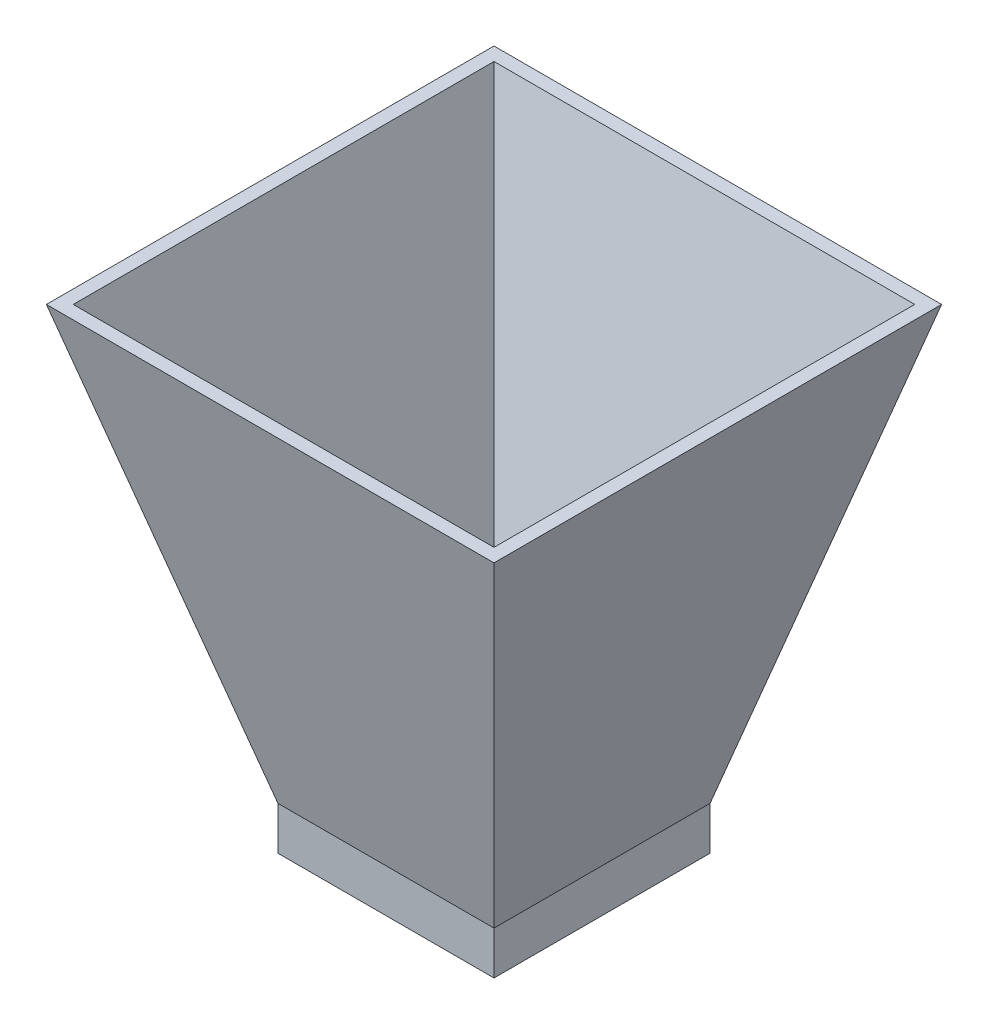
ISO-10303-21;
HEADER;
FILE_DESCRIPTION(('STEP AP214'),'2;1');
FILE_NAME('part.step','',(''),(''),'','','');
FILE_SCHEMA(('AUTOMOTIVE_DESIGN { 1 0 10303 214 1 1 1 1 }'));
ENDSEC;
DATA;
#1=APPLICATION_CONTEXT('core data for automotive mechanical design processes');
#2=APPLICATION_PROTOCOL_DEFINITION('international standard','automotive_design',2000,#1);
#3=PRODUCT_CONTEXT('',#1,'mechanical');
#4=PRODUCT('Part','Part','',(#3));
#5=PRODUCT_RELATED_PRODUCT_CATEGORY('part','',(#4));
#6=PRODUCT_DEFINITION_FORMATION('','',#4);
#7=PRODUCT_DEFINITION_CONTEXT('part definition',#1,'design');
#8=PRODUCT_DEFINITION('design','',#6,#7);
#9=PRODUCT_DEFINITION_SHAPE('','',#8);
#10=(LENGTH_UNIT() NAMED_UNIT(*) SI_UNIT(.MILLI.,.METRE.));
#11=(NAMED_UNIT(*) PLANE_ANGLE_UNIT() SI_UNIT($,.RADIAN.));
#12=(NAMED_UNIT(*) SI_UNIT($,.STERADIAN.) SOLID_ANGLE_UNIT());
#13=UNCERTAINTY_MEASURE_WITH_UNIT(LENGTH_MEASURE(1.E-05),#10,'distance_accuracy_value','');
#14=(GEOMETRIC_REPRESENTATION_CONTEXT(3) GLOBAL_UNCERTAINTY_ASSIGNED_CONTEXT((#13)) GLOBAL_UNIT_ASSIGNED_CONTEXT((#10,
#11,#12)) REPRESENTATION_CONTEXT('',''));
#15=CARTESIAN_POINT('',(0.,0.,0.));
#16=DIRECTION('',(0.,0.,1.));
#17=DIRECTION('',(1.,0.,0.));
#18=AXIS2_PLACEMENT_3D('',#15,#16,#17);
#19=CARTESIAN_POINT('',(0.,0.,0.));
#20=DIRECTION('',(-0.965925826289068,-0.258819045102521,0.));
#21=DIRECTION('',(0.258819045102521,-0.965925826289068,0.));
#22=AXIS2_PLACEMENT_3D('',#19,#20,#21);
#23=PLANE('',#22);
#24=DIRECTION('',(0.,0.,1.));
#25=VECTOR('',#24,1.);
#26=CARTESIAN_POINT('',(0.,0.,0.));
#27=LINE('',#26,#25);
#28=CARTESIAN_POINT('',(0.,0.,0.));
#29=VERTEX_POINT('',#28);
#30=CARTESIAN_POINT('',(0.,0.,50.));
#31=VERTEX_POINT('',#30);
#32=EDGE_CURVE('E190',#29,#31,#27,.T.);
#33=ORIENTED_EDGE('',*,*,#32,.T.);
#34=DIRECTION('',(0.250562807085732,-0.935113126531029,-0.250562807085732));
#35=VECTOR('',#34,1.);
#36=CARTESIAN_POINT('',(0.,0.,50.));
#37=LINE('',#36,#35);
#38=CARTESIAN_POINT('',(-26.7949192431123,100.,76.7949192431123));
#39=VERTEX_POINT('',#38);
#40=EDGE_CURVE('E223',#39,#31,#37,.T.);
#41=ORIENTED_EDGE('',*,*,#40,.F.);
#42=DIRECTION('',(0.,0.,-1.));
#43=VECTOR('',#42,1.);
#44=CARTESIAN_POINT('',(-26.7949192431123,100.,0.));
#45=LINE('',#44,#43);
#46=CARTESIAN_POINT('',(-26.7949192431123,100.,-26.7949192431123));
#47=VERTEX_POINT('',#46);
#48=EDGE_CURVE('E222',#47,#39,#45,.F.);
#49=ORIENTED_EDGE('',*,*,#48,.F.);
#50=DIRECTION('',(0.250562807085732,-0.935113126531029,0.250562807085732));
#51=VECTOR('',#50,1.);
#52=CARTESIAN_POINT('',(0.,0.,0.));
#53=LINE('',#52,#51);
#54=EDGE_CURVE('E228',#47,#29,#53,.T.);
#55=ORIENTED_EDGE('',*,*,#54,.T.);
#56=EDGE_LOOP('',(#33,#41,#49,#55));
#57=FACE_BOUND('',#56,.T.);
#58=ADVANCED_FACE('F32',(#57),#23,.T.);
#59=CARTESIAN_POINT('',(0.,0.,50.));
#60=DIRECTION('',(0.,-0.258819045102521,0.965925826289068));
#61=DIRECTION('',(0.,-0.965925826289068,-0.258819045102521));
#62=AXIS2_PLACEMENT_3D('',#59,#60,#61);
#63=PLANE('',#62);
#64=DIRECTION('',(1.,0.,0.));
#65=VECTOR('',#64,1.);
#66=CARTESIAN_POINT('',(0.,0.,50.));
#67=LINE('',#66,#65);
#68=CARTESIAN_POINT('',(50.,0.,50.));
#69=VERTEX_POINT('',#68);
#70=EDGE_CURVE('E213',#31,#69,#67,.T.);
#71=ORIENTED_EDGE('',*,*,#70,.T.);
#72=DIRECTION('',(-0.250562807085732,-0.935113126531029,-0.250562807085732));
#73=VECTOR('',#72,1.);
#74=CARTESIAN_POINT('',(46.8609139852659,-11.7152284963165,46.8609139852659));
#75=LINE('',#74,#73);
#76=CARTESIAN_POINT('',(76.7949192431123,100.,76.7949192431123));
#77=VERTEX_POINT('',#76);
#78=EDGE_CURVE('E227',#77,#69,#75,.T.);
#79=ORIENTED_EDGE('',*,*,#78,.F.);
#80=DIRECTION('',(-1.,0.,0.));
#81=VECTOR('',#80,1.);
#82=CARTESIAN_POINT('',(0.,100.,76.7949192431123));
#83=LINE('',#82,#81);
#84=EDGE_CURVE('E239',#39,#77,#83,.F.);
#85=ORIENTED_EDGE('',*,*,#84,.F.);
#86=ORIENTED_EDGE('',*,*,#40,.T.);
#87=EDGE_LOOP('',(#71,#79,#85,#86));
#88=FACE_BOUND('',#87,.T.);
#89=ADVANCED_FACE('F34',(#88),#63,.T.);
#90=CARTESIAN_POINT('',(50.,0.,0.));
#91=DIRECTION('',(0.965925826289068,-0.258819045102521,0.));
#92=DIRECTION('',(0.258819045102521,0.965925826289068,0.));
#93=AXIS2_PLACEMENT_3D('',#90,#91,#92);
#94=PLANE('',#93);
#95=DIRECTION('',(0.,0.,-1.));
#96=VECTOR('',#95,1.);
#97=CARTESIAN_POINT('',(50.,0.,0.));
#98=LINE('',#97,#96);
#99=CARTESIAN_POINT('',(50.,0.,0.));
#100=VERTEX_POINT('',#99);
#101=EDGE_CURVE('E216',#69,#100,#98,.T.);
#102=ORIENTED_EDGE('',*,*,#101,.T.);
#103=DIRECTION('',(-0.250562807085732,-0.935113126531029,0.250562807085732));
#104=VECTOR('',#103,1.);
#105=CARTESIAN_POINT('',(46.8609139852659,-11.7152284963165,3.13908601473409));
#106=LINE('',#105,#104);
#107=CARTESIAN_POINT('',(76.7949192431123,100.,-26.7949192431123));
#108=VERTEX_POINT('',#107);
#109=EDGE_CURVE('E231',#108,#100,#106,.T.);
#110=ORIENTED_EDGE('',*,*,#109,.F.);
#111=DIRECTION('',(0.,0.,1.));
#112=VECTOR('',#111,1.);
#113=CARTESIAN_POINT('',(76.7949192431123,100.,0.));
#114=LINE('',#113,#112);
#115=EDGE_CURVE('E241',#77,#108,#114,.F.);
#116=ORIENTED_EDGE('',*,*,#115,.F.);
#117=ORIENTED_EDGE('',*,*,#78,.T.);
#118=EDGE_LOOP('',(#102,#110,#116,#117));
#119=FACE_BOUND('',#118,.T.);
#120=ADVANCED_FACE('F271',(#119),#94,.T.);
#121=CARTESIAN_POINT('',(0.,0.,0.));
#122=DIRECTION('',(0.,-0.258819045102521,-0.965925826289068));
#123=DIRECTION('',(0.,0.965925826289068,-0.258819045102521));
#124=AXIS2_PLACEMENT_3D('',#121,#122,#123);
#125=PLANE('',#124);
#126=DIRECTION('',(-1.,0.,0.));
#127=VECTOR('',#126,1.);
#128=CARTESIAN_POINT('',(0.,0.,0.));
#129=LINE('',#128,#127);
#130=EDGE_CURVE('E219',#100,#29,#129,.T.);
#131=ORIENTED_EDGE('',*,*,#130,.T.);
#132=ORIENTED_EDGE('',*,*,#54,.F.);
#133=DIRECTION('',(1.,0.,0.));
#134=VECTOR('',#133,1.);
#135=CARTESIAN_POINT('',(0.,100.,-26.7949192431123));
#136=LINE('',#135,#134);
#137=EDGE_CURVE('E232',#108,#47,#136,.F.);
#138=ORIENTED_EDGE('',*,*,#137,.F.);
#139=ORIENTED_EDGE('',*,*,#109,.T.);
#140=EDGE_LOOP('',(#131,#132,#138,#139));
#141=FACE_BOUND('',#140,.T.);
#142=ADVANCED_FACE('F277',(#141),#125,.T.);
#143=CARTESIAN_POINT('',(0.,100.,0.));
#144=DIRECTION('',(0.,1.,0.));
#145=DIRECTION('',(0.,0.,1.));
#146=AXIS2_PLACEMENT_3D('',#143,#144,#145);
#147=PLANE('',#146);
#148=DIRECTION('',(0.,0.,-1.));
#149=VECTOR('',#148,1.);
#150=CARTESIAN_POINT('',(-23.6890907018821,100.,0.));
#151=LINE('',#150,#149);
#152=CARTESIAN_POINT('',(-23.6890907018821,100.,-23.6890907018821));
#153=VERTEX_POINT('',#152);
#154=CARTESIAN_POINT('',(-23.6890907018821,100.,73.6890907018821));
#155=VERTEX_POINT('',#154);
#156=EDGE_CURVE('E204',#153,#155,#151,.F.);
#157=ORIENTED_EDGE('',*,*,#156,.F.);
#158=DIRECTION('',(1.,0.,0.));
#159=VECTOR('',#158,1.);
#160=CARTESIAN_POINT('',(0.,100.,-23.6890907018821));
#161=LINE('',#160,#159);
#162=CARTESIAN_POINT('',(73.6890907018821,100.,-23.6890907018821));
#163=VERTEX_POINT('',#162);
#164=EDGE_CURVE('E195',#163,#153,#161,.F.);
#165=ORIENTED_EDGE('',*,*,#164,.F.);
#166=DIRECTION('',(0.,0.,1.));
#167=VECTOR('',#166,1.);
#168=CARTESIAN_POINT('',(73.6890907018821,100.,0.));
#169=LINE('',#168,#167);
#170=CARTESIAN_POINT('',(73.6890907018821,100.,73.6890907018821));
#171=VERTEX_POINT('',#170);
#172=EDGE_CURVE('E208',#171,#163,#169,.F.);
#173=ORIENTED_EDGE('',*,*,#172,.F.);
#174=DIRECTION('',(-1.,0.,0.));
#175=VECTOR('',#174,1.);
#176=CARTESIAN_POINT('',(0.,100.,73.6890907018821));
#177=LINE('',#176,#175);
#178=EDGE_CURVE('E206',#155,#171,#177,.F.);
#179=ORIENTED_EDGE('',*,*,#178,.F.);
#180=EDGE_LOOP('',(#157,#165,#173,#179));
#181=FACE_BOUND('',#180,.T.);
#182=ORIENTED_EDGE('',*,*,#48,.T.);
#183=ORIENTED_EDGE('',*,*,#84,.T.);
#184=ORIENTED_EDGE('',*,*,#115,.T.);
#185=ORIENTED_EDGE('',*,*,#137,.T.);
#186=EDGE_LOOP('',(#182,#183,#184,#185));
#187=FACE_BOUND('',#186,.T.);
#188=ADVANCED_FACE('F275',(#181,#187),#147,.T.);
#189=CARTESIAN_POINT('',(2.8977774788672,0.776457135307564,0.));
#190=DIRECTION('',(-0.965925826289068,-0.258819045102521,0.));
#191=DIRECTION('',(0.258819045102521,-0.965925826289068,0.));
#192=AXIS2_PLACEMENT_3D('',#189,#190,#191);
#193=PLANE('',#192);
#194=DIRECTION('',(0.,0.,-1.));
#195=VECTOR('',#194,1.);
#196=CARTESIAN_POINT('',(2.30198096393688,3.,0.));
#197=LINE('',#196,#195);
#198=CARTESIAN_POINT('',(2.30198096393688,3.,2.30198096393688));
#199=VERTEX_POINT('',#198);
#200=CARTESIAN_POINT('',(2.30198096393688,3.,47.6980190360631));
#201=VERTEX_POINT('',#200);
#202=EDGE_CURVE('E143',#199,#201,#197,.F.);
#203=ORIENTED_EDGE('',*,*,#202,.F.);
#204=DIRECTION('',(0.250562807085732,-0.935113126531029,0.250562807085732));
#205=VECTOR('',#204,1.);
#206=CARTESIAN_POINT('',(2.71585002371274,1.45541964123575,2.71585002371273));
#207=LINE('',#206,#205);
#208=EDGE_CURVE('E192',#153,#199,#207,.T.);
#209=ORIENTED_EDGE('',*,*,#208,.F.);
#210=ORIENTED_EDGE('',*,*,#156,.T.);
#211=DIRECTION('',(0.250562807085732,-0.935113126531029,-0.250562807085732));
#212=VECTOR('',#211,1.);
#213=CARTESIAN_POINT('',(2.71585002371273,1.45541964123575,47.2841499762873));
#214=LINE('',#213,#212);
#215=EDGE_CURVE('E187',#155,#201,#214,.T.);
#216=ORIENTED_EDGE('',*,*,#215,.T.);
#217=EDGE_LOOP('',(#203,#209,#210,#216));
#218=FACE_BOUND('',#217,.T.);
#219=ADVANCED_FACE('F327',(#218),#193,.F.);
#220=CARTESIAN_POINT('',(0.,0.776457135307564,47.1022225211328));
#221=DIRECTION('',(0.,-0.258819045102521,0.965925826289068));
#222=DIRECTION('',(0.,-0.965925826289068,-0.258819045102521));
#223=AXIS2_PLACEMENT_3D('',#220,#221,#222);
#224=PLANE('',#223);
#225=DIRECTION('',(-1.,0.,0.));
#226=VECTOR('',#225,1.);
#227=CARTESIAN_POINT('',(0.,3.,47.6980190360631));
#228=LINE('',#227,#226);
#229=CARTESIAN_POINT('',(47.6980190360631,3.,47.6980190360631));
#230=VERTEX_POINT('',#229);
#231=EDGE_CURVE('E186',#201,#230,#228,.F.);
#232=ORIENTED_EDGE('',*,*,#231,.F.);
#233=ORIENTED_EDGE('',*,*,#215,.F.);
#234=ORIENTED_EDGE('',*,*,#178,.T.);
#235=DIRECTION('',(-0.250562807085732,-0.935113126531029,-0.250562807085732));
#236=VECTOR('',#235,1.);
#237=CARTESIAN_POINT('',(44.1450639615532,-10.2598088550808,44.1450639615532));
#238=LINE('',#237,#236);
#239=EDGE_CURVE('E191',#171,#230,#238,.T.);
#240=ORIENTED_EDGE('',*,*,#239,.T.);
#241=EDGE_LOOP('',(#232,#233,#234,#240));
#242=FACE_BOUND('',#241,.T.);
#243=ADVANCED_FACE('F330',(#242),#224,.F.);
#244=CARTESIAN_POINT('',(47.1022225211328,0.776457135307564,0.));
#245=DIRECTION('',(0.965925826289068,-0.258819045102521,0.));
#246=DIRECTION('',(0.258819045102521,0.965925826289068,0.));
#247=AXIS2_PLACEMENT_3D('',#244,#245,#246);
#248=PLANE('',#247);
#249=DIRECTION('',(0.,0.,1.));
#250=VECTOR('',#249,1.);
#251=CARTESIAN_POINT('',(47.6980190360631,3.,0.));
#252=LINE('',#251,#250);
#253=CARTESIAN_POINT('',(47.6980190360631,3.,2.30198096393688));
#254=VERTEX_POINT('',#253);
#255=EDGE_CURVE('E197',#230,#254,#252,.F.);
#256=ORIENTED_EDGE('',*,*,#255,.F.);
#257=ORIENTED_EDGE('',*,*,#239,.F.);
#258=ORIENTED_EDGE('',*,*,#172,.T.);
#259=DIRECTION('',(-0.250562807085732,-0.935113126531029,0.250562807085732));
#260=VECTOR('',#259,1.);
#261=CARTESIAN_POINT('',(44.1450639615532,-10.2598088550808,5.85493603844683));
#262=LINE('',#261,#260);
#263=EDGE_CURVE('E55',#163,#254,#262,.T.);
#264=ORIENTED_EDGE('',*,*,#263,.T.);
#265=EDGE_LOOP('',(#256,#257,#258,#264));
#266=FACE_BOUND('',#265,.T.);
#267=ADVANCED_FACE('F334',(#266),#248,.F.);
#268=CARTESIAN_POINT('',(0.,0.776457135307564,2.8977774788672));
#269=DIRECTION('',(0.,-0.258819045102521,-0.965925826289068));
#270=DIRECTION('',(0.,0.965925826289068,-0.258819045102521));
#271=AXIS2_PLACEMENT_3D('',#268,#269,#270);
#272=PLANE('',#271);
#273=DIRECTION('',(1.,0.,0.));
#274=VECTOR('',#273,1.);
#275=CARTESIAN_POINT('',(0.,3.,2.30198096393688));
#276=LINE('',#275,#274);
#277=EDGE_CURVE('E201',#254,#199,#276,.F.);
#278=ORIENTED_EDGE('',*,*,#277,.F.);
#279=ORIENTED_EDGE('',*,*,#263,.F.);
#280=ORIENTED_EDGE('',*,*,#164,.T.);
#281=ORIENTED_EDGE('',*,*,#208,.T.);
#282=EDGE_LOOP('',(#278,#279,#280,#281));
#283=FACE_BOUND('',#282,.T.);
#284=ADVANCED_FACE('F325',(#283),#272,.F.);
#285=CARTESIAN_POINT('',(0.,3.,0.));
#286=DIRECTION('',(0.,1.,0.));
#287=DIRECTION('',(0.,0.,1.));
#288=AXIS2_PLACEMENT_3D('',#285,#286,#287);
#289=PLANE('',#288);
#290=DIRECTION('',(0.,0.,-1.));
#291=VECTOR('',#290,1.);
#292=CARTESIAN_POINT('',(47.,3.,0.));
#293=LINE('',#292,#291);
#294=CARTESIAN_POINT('',(47.,3.,47.));
#295=VERTEX_POINT('',#294);
#296=CARTESIAN_POINT('',(47.,3.,3.));
#297=VERTEX_POINT('',#296);
#298=EDGE_CURVE('E11',#295,#297,#293,.T.);
#299=ORIENTED_EDGE('',*,*,#298,.F.);
#300=DIRECTION('',(1.,0.,0.));
#301=VECTOR('',#300,1.);
#302=CARTESIAN_POINT('',(0.,3.,47.));
#303=LINE('',#302,#301);
#304=CARTESIAN_POINT('',(3.,3.,47.));
#305=VERTEX_POINT('',#304);
#306=EDGE_CURVE('E226',#305,#295,#303,.T.);
#307=ORIENTED_EDGE('',*,*,#306,.F.);
#308=DIRECTION('',(0.,0.,1.));
#309=VECTOR('',#308,1.);
#310=CARTESIAN_POINT('',(3.,3.,0.));
#311=LINE('',#310,#309);
#312=CARTESIAN_POINT('',(3.,3.,3.));
#313=VERTEX_POINT('',#312);
#314=EDGE_CURVE('E245',#313,#305,#311,.T.);
#315=ORIENTED_EDGE('',*,*,#314,.F.);
#316=DIRECTION('',(-1.,0.,0.));
#317=VECTOR('',#316,1.);
#318=CARTESIAN_POINT('',(0.,3.,3.));
#319=LINE('',#318,#317);
#320=EDGE_CURVE('E40',#297,#313,#319,.T.);
#321=ORIENTED_EDGE('',*,*,#320,.F.);
#322=EDGE_LOOP('',(#299,#307,#315,#321));
#323=FACE_BOUND('',#322,.T.);
#324=ORIENTED_EDGE('',*,*,#202,.T.);
#325=ORIENTED_EDGE('',*,*,#231,.T.);
#326=ORIENTED_EDGE('',*,*,#255,.T.);
#327=ORIENTED_EDGE('',*,*,#277,.T.);
#328=EDGE_LOOP('',(#324,#325,#326,#327));
#329=FACE_BOUND('',#328,.T.);
#330=ADVANCED_FACE('F251',(#323,#329),#289,.T.);
#331=CARTESIAN_POINT('',(47.,100.,0.));
#332=DIRECTION('',(1.,0.,0.));
#333=DIRECTION('',(0.,0.,-1.));
#334=AXIS2_PLACEMENT_3D('',#331,#332,#333);
#335=PLANE('',#334);
#336=ORIENTED_EDGE('',*,*,#298,.T.);
#337=DIRECTION('',(0.,-1.,0.));
#338=VECTOR('',#337,1.);
#339=CARTESIAN_POINT('',(47.,100.,3.));
#340=LINE('',#339,#338);
#341=CARTESIAN_POINT('',(47.,-10.,3.));
#342=VERTEX_POINT('',#341);
#343=EDGE_CURVE('E133',#297,#342,#340,.T.);
#344=ORIENTED_EDGE('',*,*,#343,.T.);
#345=DIRECTION('',(0.,0.,1.));
#346=VECTOR('',#345,1.);
#347=CARTESIAN_POINT('',(47.,-10.,3.));
#348=LINE('',#347,#346);
#349=CARTESIAN_POINT('',(47.,-10.,47.));
#350=VERTEX_POINT('',#349);
#351=EDGE_CURVE('E138',#342,#350,#348,.T.);
#352=ORIENTED_EDGE('',*,*,#351,.T.);
#353=DIRECTION('',(0.,-1.,0.));
#354=VECTOR('',#353,1.);
#355=CARTESIAN_POINT('',(47.,100.,47.));
#356=LINE('',#355,#354);
#357=EDGE_CURVE('E179',#295,#350,#356,.T.);
#358=ORIENTED_EDGE('',*,*,#357,.F.);
#359=EDGE_LOOP('',(#336,#344,#352,#358));
#360=FACE_BOUND('',#359,.T.);
#361=ADVANCED_FACE('F135',(#360),#335,.F.);
#362=CARTESIAN_POINT('',(0.,100.,3.));
#363=DIRECTION('',(0.,0.,-1.));
#364=DIRECTION('',(-1.,0.,0.));
#365=AXIS2_PLACEMENT_3D('',#362,#363,#364);
#366=PLANE('',#365);
#367=ORIENTED_EDGE('',*,*,#320,.T.);
#368=DIRECTION('',(0.,-1.,0.));
#369=VECTOR('',#368,1.);
#370=CARTESIAN_POINT('',(3.,100.,3.));
#371=LINE('',#370,#369);
#372=CARTESIAN_POINT('',(3.,-10.,3.));
#373=VERTEX_POINT('',#372);
#374=EDGE_CURVE('E144',#313,#373,#371,.T.);
#375=ORIENTED_EDGE('',*,*,#374,.T.);
#376=DIRECTION('',(1.,0.,0.));
#377=VECTOR('',#376,1.);
#378=CARTESIAN_POINT('',(3.,-10.,3.));
#379=LINE('',#378,#377);
#380=EDGE_CURVE('E147',#373,#342,#379,.T.);
#381=ORIENTED_EDGE('',*,*,#380,.T.);
#382=ORIENTED_EDGE('',*,*,#343,.F.);
#383=EDGE_LOOP('',(#367,#375,#381,#382));
#384=FACE_BOUND('',#383,.T.);
#385=ADVANCED_FACE('F148',(#384),#366,.F.);
#386=CARTESIAN_POINT('',(3.,100.,0.));
#387=DIRECTION('',(-1.,0.,0.));
#388=DIRECTION('',(0.,0.,1.));
#389=AXIS2_PLACEMENT_3D('',#386,#387,#388);
#390=PLANE('',#389);
#391=ORIENTED_EDGE('',*,*,#314,.T.);
#392=DIRECTION('',(0.,-1.,0.));
#393=VECTOR('',#392,1.);
#394=CARTESIAN_POINT('',(3.,100.,47.));
#395=LINE('',#394,#393);
#396=CARTESIAN_POINT('',(3.,-10.,47.));
#397=VERTEX_POINT('',#396);
#398=EDGE_CURVE('E47',#305,#397,#395,.T.);
#399=ORIENTED_EDGE('',*,*,#398,.T.);
#400=DIRECTION('',(0.,0.,-1.));
#401=VECTOR('',#400,1.);
#402=CARTESIAN_POINT('',(3.,-10.,47.));
#403=LINE('',#402,#401);
#404=EDGE_CURVE('E157',#397,#373,#403,.T.);
#405=ORIENTED_EDGE('',*,*,#404,.T.);
#406=ORIENTED_EDGE('',*,*,#374,.F.);
#407=EDGE_LOOP('',(#391,#399,#405,#406));
#408=FACE_BOUND('',#407,.T.);
#409=ADVANCED_FACE('F249',(#408),#390,.F.);
#410=CARTESIAN_POINT('',(0.,100.,47.));
#411=DIRECTION('',(0.,0.,1.));
#412=DIRECTION('',(1.,0.,0.));
#413=AXIS2_PLACEMENT_3D('',#410,#411,#412);
#414=PLANE('',#413);
#415=ORIENTED_EDGE('',*,*,#306,.T.);
#416=ORIENTED_EDGE('',*,*,#357,.T.);
#417=DIRECTION('',(-1.,0.,0.));
#418=VECTOR('',#417,1.);
#419=CARTESIAN_POINT('',(47.,-10.,47.));
#420=LINE('',#419,#418);
#421=EDGE_CURVE('E155',#350,#397,#420,.T.);
#422=ORIENTED_EDGE('',*,*,#421,.T.);
#423=ORIENTED_EDGE('',*,*,#398,.F.);
#424=EDGE_LOOP('',(#415,#416,#422,#423));
#425=FACE_BOUND('',#424,.T.);
#426=ADVANCED_FACE('F253',(#425),#414,.F.);
#427=CARTESIAN_POINT('',(0.,-10.,0.));
#428=DIRECTION('',(0.,-1.,0.));
#429=DIRECTION('',(0.,0.,-1.));
#430=AXIS2_PLACEMENT_3D('',#427,#428,#429);
#431=PLANE('',#430);
#432=DIRECTION('',(-1.,0.,0.));
#433=VECTOR('',#432,1.);
#434=CARTESIAN_POINT('',(50.,-10.,50.));
#435=LINE('',#434,#433);
#436=CARTESIAN_POINT('',(50.,-10.,50.));
#437=VERTEX_POINT('',#436);
#438=CARTESIAN_POINT('',(0.,-10.,50.));
#439=VERTEX_POINT('',#438);
#440=EDGE_CURVE('E161',#437,#439,#435,.T.);
#441=ORIENTED_EDGE('',*,*,#440,.T.);
#442=DIRECTION('',(0.,0.,-1.));
#443=VECTOR('',#442,1.);
#444=CARTESIAN_POINT('',(0.,-10.,50.));
#445=LINE('',#444,#443);
#446=CARTESIAN_POINT('',(0.,-10.,0.));
#447=VERTEX_POINT('',#446);
#448=EDGE_CURVE('E164',#439,#447,#445,.T.);
#449=ORIENTED_EDGE('',*,*,#448,.T.);
#450=DIRECTION('',(1.,0.,0.));
#451=VECTOR('',#450,1.);
#452=CARTESIAN_POINT('',(0.,-10.,0.));
#453=LINE('',#452,#451);
#454=CARTESIAN_POINT('',(50.,-10.,0.));
#455=VERTEX_POINT('',#454);
#456=EDGE_CURVE('E166',#447,#455,#453,.T.);
#457=ORIENTED_EDGE('',*,*,#456,.T.);
#458=DIRECTION('',(0.,0.,1.));
#459=VECTOR('',#458,1.);
#460=CARTESIAN_POINT('',(50.,-10.,0.));
#461=LINE('',#460,#459);
#462=EDGE_CURVE('E168',#455,#437,#461,.T.);
#463=ORIENTED_EDGE('',*,*,#462,.T.);
#464=EDGE_LOOP('',(#441,#449,#457,#463));
#465=FACE_BOUND('',#464,.T.);
#466=ORIENTED_EDGE('',*,*,#351,.F.);
#467=ORIENTED_EDGE('',*,*,#380,.F.);
#468=ORIENTED_EDGE('',*,*,#404,.F.);
#469=ORIENTED_EDGE('',*,*,#421,.F.);
#470=EDGE_LOOP('',(#466,#467,#468,#469));
#471=FACE_BOUND('',#470,.T.);
#472=ADVANCED_FACE('F154',(#465,#471),#431,.T.);
#473=CARTESIAN_POINT('',(50.,-10.,50.));
#474=DIRECTION('',(0.,0.,-1.));
#475=DIRECTION('',(-1.,0.,0.));
#476=AXIS2_PLACEMENT_3D('',#473,#474,#475);
#477=PLANE('',#476);
#478=ORIENTED_EDGE('',*,*,#70,.F.);
#479=DIRECTION('',(0.,1.,0.));
#480=VECTOR('',#479,1.);
#481=CARTESIAN_POINT('',(0.,-10.,50.));
#482=LINE('',#481,#480);
#483=EDGE_CURVE('E178',#439,#31,#482,.T.);
#484=ORIENTED_EDGE('',*,*,#483,.F.);
#485=ORIENTED_EDGE('',*,*,#440,.F.);
#486=DIRECTION('',(0.,1.,0.));
#487=VECTOR('',#486,1.);
#488=CARTESIAN_POINT('',(50.,-10.,50.));
#489=LINE('',#488,#487);
#490=EDGE_CURVE('E170',#437,#69,#489,.T.);
#491=ORIENTED_EDGE('',*,*,#490,.T.);
#492=EDGE_LOOP('',(#478,#484,#485,#491));
#493=FACE_BOUND('',#492,.T.);
#494=ADVANCED_FACE('F260',(#493),#477,.F.);
#495=CARTESIAN_POINT('',(0.,-10.,50.));
#496=DIRECTION('',(1.,0.,0.));
#497=DIRECTION('',(0.,0.,-1.));
#498=AXIS2_PLACEMENT_3D('',#495,#496,#497);
#499=PLANE('',#498);
#500=ORIENTED_EDGE('',*,*,#32,.F.);
#501=DIRECTION('',(0.,1.,0.));
#502=VECTOR('',#501,1.);
#503=CARTESIAN_POINT('',(0.,-10.,0.));
#504=LINE('',#503,#502);
#505=EDGE_CURVE('E175',#447,#29,#504,.T.);
#506=ORIENTED_EDGE('',*,*,#505,.F.);
#507=ORIENTED_EDGE('',*,*,#448,.F.);
#508=ORIENTED_EDGE('',*,*,#483,.T.);
#509=EDGE_LOOP('',(#500,#506,#507,#508));
#510=FACE_BOUND('',#509,.T.);
#511=ADVANCED_FACE('F307',(#510),#499,.F.);
#512=CARTESIAN_POINT('',(0.,-10.,0.));
#513=DIRECTION('',(0.,0.,1.));
#514=DIRECTION('',(1.,0.,0.));
#515=AXIS2_PLACEMENT_3D('',#512,#513,#514);
#516=PLANE('',#515);
#517=ORIENTED_EDGE('',*,*,#130,.F.);
#518=DIRECTION('',(0.,1.,0.));
#519=VECTOR('',#518,1.);
#520=CARTESIAN_POINT('',(50.,-10.,0.));
#521=LINE('',#520,#519);
#522=EDGE_CURVE('E172',#455,#100,#521,.T.);
#523=ORIENTED_EDGE('',*,*,#522,.F.);
#524=ORIENTED_EDGE('',*,*,#456,.F.);
#525=ORIENTED_EDGE('',*,*,#505,.T.);
#526=EDGE_LOOP('',(#517,#523,#524,#525));
#527=FACE_BOUND('',#526,.T.);
#528=ADVANCED_FACE('F305',(#527),#516,.F.);
#529=CARTESIAN_POINT('',(50.,-10.,0.));
#530=DIRECTION('',(-1.,0.,0.));
#531=DIRECTION('',(0.,0.,1.));
#532=AXIS2_PLACEMENT_3D('',#529,#530,#531);
#533=PLANE('',#532);
#534=ORIENTED_EDGE('',*,*,#101,.F.);
#535=ORIENTED_EDGE('',*,*,#490,.F.);
#536=ORIENTED_EDGE('',*,*,#462,.F.);
#537=ORIENTED_EDGE('',*,*,#522,.T.);
#538=EDGE_LOOP('',(#534,#535,#536,#537));
#539=FACE_BOUND('',#538,.T.);
#540=ADVANCED_FACE('F300',(#539),#533,.F.);
#541=CLOSED_SHELL('',(#58,#89,#120,#142,#188,#219,#243,#267,#284,#330,#361,#385,#409,#426,#472,
#494,#511,#528,#540));
#542=MANIFOLD_SOLID_BREP('B2',#541);
#543=ADVANCED_BREP_SHAPE_REPRESENTATION('',(#18,#542),#14);
#544=SHAPE_DEFINITION_REPRESENTATION(#9,#543);
ENDSEC;
END-ISO-10303-21;
